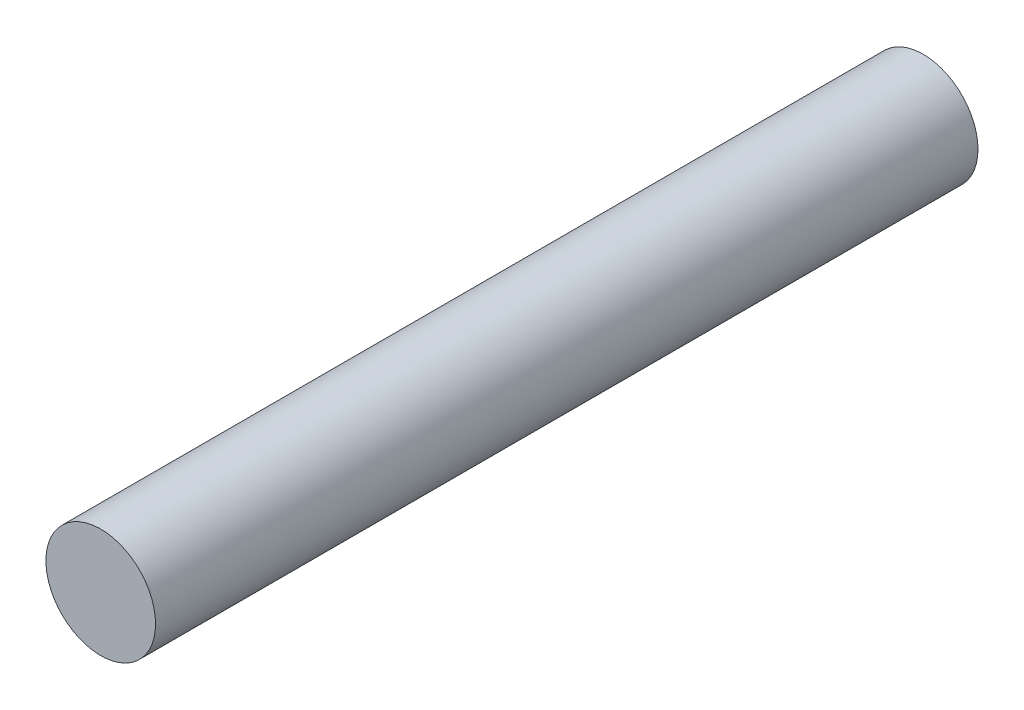
ISO-10303-21;
HEADER;
FILE_DESCRIPTION(('STEP AP214'),'2;1');
FILE_NAME('part.step','',(''),(''),'','','');
FILE_SCHEMA(('AUTOMOTIVE_DESIGN { 1 0 10303 214 1 1 1 1 }'));
ENDSEC;
DATA;
#1=APPLICATION_CONTEXT('core data for automotive mechanical design processes');
#2=APPLICATION_PROTOCOL_DEFINITION('international standard','automotive_design',2000,#1);
#3=PRODUCT_CONTEXT('',#1,'mechanical');
#4=PRODUCT('Part','Part','',(#3));
#5=PRODUCT_RELATED_PRODUCT_CATEGORY('part','',(#4));
#6=PRODUCT_DEFINITION_FORMATION('','',#4);
#7=PRODUCT_DEFINITION_CONTEXT('part definition',#1,'design');
#8=PRODUCT_DEFINITION('design','',#6,#7);
#9=PRODUCT_DEFINITION_SHAPE('','',#8);
#10=(LENGTH_UNIT() NAMED_UNIT(*) SI_UNIT(.MILLI.,.METRE.));
#11=(NAMED_UNIT(*) PLANE_ANGLE_UNIT() SI_UNIT($,.RADIAN.));
#12=(NAMED_UNIT(*) SI_UNIT($,.STERADIAN.) SOLID_ANGLE_UNIT());
#13=UNCERTAINTY_MEASURE_WITH_UNIT(LENGTH_MEASURE(1.E-05),#10,'distance_accuracy_value','');
#14=(GEOMETRIC_REPRESENTATION_CONTEXT(3) GLOBAL_UNCERTAINTY_ASSIGNED_CONTEXT((#13)) GLOBAL_UNIT_ASSIGNED_CONTEXT((#10,
#11,#12)) REPRESENTATION_CONTEXT('',''));
#15=CARTESIAN_POINT('',(0.,0.,0.));
#16=DIRECTION('',(0.,0.,1.));
#17=DIRECTION('',(1.,0.,0.));
#18=AXIS2_PLACEMENT_3D('',#15,#16,#17);
#19=CARTESIAN_POINT('',(0.,0.,30.));
#20=DIRECTION('',(0.,0.,-1.));
#21=DIRECTION('',(-1.,0.,0.));
#22=AXIS2_PLACEMENT_3D('',#19,#20,#21);
#23=CYLINDRICAL_SURFACE('',#22,2.);
#24=CARTESIAN_POINT('',(0.,0.,30.));
#25=DIRECTION('',(0.,0.,1.));
#26=DIRECTION('',(1.,0.,0.));
#27=AXIS2_PLACEMENT_3D('',#24,#25,#26);
#28=CIRCLE('',#27,2.);
#29=CARTESIAN_POINT('',(2.,0.,30.));
#30=VERTEX_POINT('',#29);
#31=EDGE_CURVE('E10',#30,#30,#28,.T.);
#32=ORIENTED_EDGE('',*,*,#31,.F.);
#33=EDGE_LOOP('',(#32));
#34=FACE_BOUND('',#33,.T.);
#35=CARTESIAN_POINT('',(0.,0.,0.));
#36=DIRECTION('',(0.,0.,1.));
#37=DIRECTION('',(1.,0.,0.));
#38=AXIS2_PLACEMENT_3D('',#35,#36,#37);
#39=CIRCLE('',#38,2.);
#40=CARTESIAN_POINT('',(2.,0.,0.));
#41=VERTEX_POINT('',#40);
#42=EDGE_CURVE('E36',#41,#41,#39,.T.);
#43=ORIENTED_EDGE('',*,*,#42,.T.);
#44=EDGE_LOOP('',(#43));
#45=FACE_BOUND('',#44,.T.);
#46=ADVANCED_FACE('F33',(#34,#45),#23,.T.);
#47=CARTESIAN_POINT('',(0.,0.,30.));
#48=DIRECTION('',(0.,0.,1.));
#49=DIRECTION('',(1.,0.,0.));
#50=AXIS2_PLACEMENT_3D('',#47,#48,#49);
#51=PLANE('',#50);
#52=ORIENTED_EDGE('',*,*,#31,.T.);
#53=EDGE_LOOP('',(#52));
#54=FACE_BOUND('',#53,.T.);
#55=ADVANCED_FACE('F48',(#54),#51,.T.);
#56=CARTESIAN_POINT('',(0.,0.,0.));
#57=DIRECTION('',(0.,0.,1.));
#58=DIRECTION('',(1.,0.,0.));
#59=AXIS2_PLACEMENT_3D('',#56,#57,#58);
#60=PLANE('',#59);
#61=ORIENTED_EDGE('',*,*,#42,.F.);
#62=EDGE_LOOP('',(#61));
#63=FACE_BOUND('',#62,.T.);
#64=ADVANCED_FACE('F46',(#63),#60,.F.);
#65=CLOSED_SHELL('',(#46,#55,#64));
#66=MANIFOLD_SOLID_BREP('B2',#65);
#67=ADVANCED_BREP_SHAPE_REPRESENTATION('',(#18,#66),#14);
#68=SHAPE_DEFINITION_REPRESENTATION(#9,#67);
ENDSEC;
END-ISO-10303-21;
